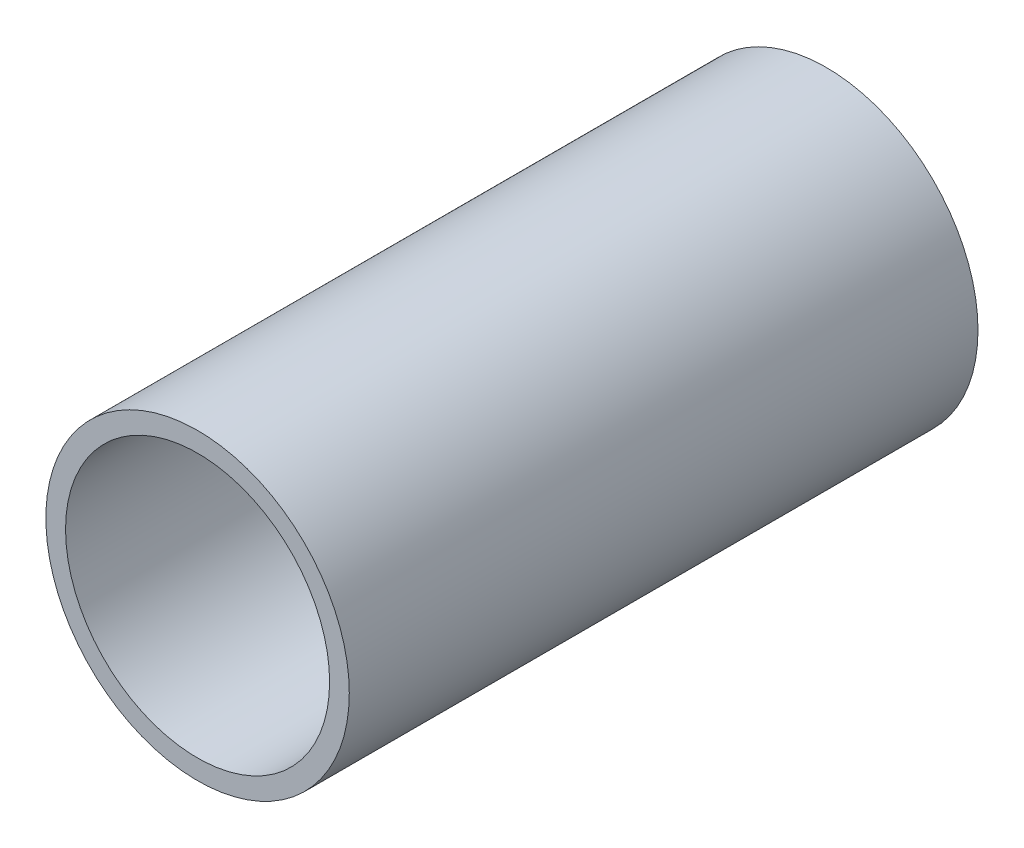
ISO-10303-21;
HEADER;
FILE_DESCRIPTION(('STEP AP214'),'2;1');
FILE_NAME('part.step','',(''),(''),'','','');
FILE_SCHEMA(('AUTOMOTIVE_DESIGN { 1 0 10303 214 1 1 1 1 }'));
ENDSEC;
DATA;
#1=APPLICATION_CONTEXT('core data for automotive mechanical design processes');
#2=APPLICATION_PROTOCOL_DEFINITION('international standard','automotive_design',2000,#1);
#3=PRODUCT_CONTEXT('',#1,'mechanical');
#4=PRODUCT('Part','Part','',(#3));
#5=PRODUCT_RELATED_PRODUCT_CATEGORY('part','',(#4));
#6=PRODUCT_DEFINITION_FORMATION('','',#4);
#7=PRODUCT_DEFINITION_CONTEXT('part definition',#1,'design');
#8=PRODUCT_DEFINITION('design','',#6,#7);
#9=PRODUCT_DEFINITION_SHAPE('','',#8);
#10=(LENGTH_UNIT() NAMED_UNIT(*) SI_UNIT(.MILLI.,.METRE.));
#11=(NAMED_UNIT(*) PLANE_ANGLE_UNIT() SI_UNIT($,.RADIAN.));
#12=(NAMED_UNIT(*) SI_UNIT($,.STERADIAN.) SOLID_ANGLE_UNIT());
#13=UNCERTAINTY_MEASURE_WITH_UNIT(LENGTH_MEASURE(1.E-05),#10,'distance_accuracy_value','');
#14=(GEOMETRIC_REPRESENTATION_CONTEXT(3) GLOBAL_UNCERTAINTY_ASSIGNED_CONTEXT((#13)) GLOBAL_UNIT_ASSIGNED_CONTEXT((#10,
#11,#12)) REPRESENTATION_CONTEXT('',''));
#15=CARTESIAN_POINT('',(0.,0.,0.));
#16=DIRECTION('',(0.,0.,1.));
#17=DIRECTION('',(1.,0.,0.));
#18=AXIS2_PLACEMENT_3D('',#15,#16,#17);
#19=CARTESIAN_POINT('',(0.,0.,125.));
#20=DIRECTION('',(0.,0.,1.));
#21=DIRECTION('',(1.,0.,0.));
#22=AXIS2_PLACEMENT_3D('',#19,#20,#21);
#23=PLANE('',#22);
#24=CARTESIAN_POINT('',(0.,0.,125.));
#25=DIRECTION('',(0.,0.,1.));
#26=DIRECTION('',(1.,0.,0.));
#27=AXIS2_PLACEMENT_3D('',#24,#25,#26);
#28=CIRCLE('',#27,30.165);
#29=CARTESIAN_POINT('',(30.165,0.,125.));
#30=VERTEX_POINT('',#29);
#31=EDGE_CURVE('E10',#30,#30,#28,.T.);
#32=ORIENTED_EDGE('',*,*,#31,.T.);
#33=EDGE_LOOP('',(#32));
#34=FACE_BOUND('',#33,.T.);
#35=CARTESIAN_POINT('',(0.,0.,125.));
#36=DIRECTION('',(0.,0.,1.));
#37=DIRECTION('',(1.,0.,0.));
#38=AXIS2_PLACEMENT_3D('',#35,#36,#37);
#39=CIRCLE('',#38,26.25);
#40=CARTESIAN_POINT('',(26.25,0.,125.));
#41=VERTEX_POINT('',#40);
#42=EDGE_CURVE('E52',#41,#41,#39,.T.);
#43=ORIENTED_EDGE('',*,*,#42,.F.);
#44=EDGE_LOOP('',(#43));
#45=FACE_BOUND('',#44,.T.);
#46=ADVANCED_FACE('F39',(#34,#45),#23,.T.);
#47=CARTESIAN_POINT('',(0.,0.,0.));
#48=DIRECTION('',(0.,0.,1.));
#49=DIRECTION('',(1.,0.,0.));
#50=AXIS2_PLACEMENT_3D('',#47,#48,#49);
#51=PLANE('',#50);
#52=CARTESIAN_POINT('',(0.,0.,0.));
#53=DIRECTION('',(0.,0.,1.));
#54=DIRECTION('',(1.,0.,0.));
#55=AXIS2_PLACEMENT_3D('',#52,#53,#54);
#56=CIRCLE('',#55,30.165);
#57=CARTESIAN_POINT('',(30.165,0.,0.));
#58=VERTEX_POINT('',#57);
#59=EDGE_CURVE('E43',#58,#58,#56,.T.);
#60=ORIENTED_EDGE('',*,*,#59,.F.);
#61=EDGE_LOOP('',(#60));
#62=FACE_BOUND('',#61,.T.);
#63=CARTESIAN_POINT('',(0.,0.,0.));
#64=DIRECTION('',(0.,0.,1.));
#65=DIRECTION('',(1.,0.,0.));
#66=AXIS2_PLACEMENT_3D('',#63,#64,#65);
#67=CIRCLE('',#66,26.25);
#68=CARTESIAN_POINT('',(26.25,0.,0.));
#69=VERTEX_POINT('',#68);
#70=EDGE_CURVE('E54',#69,#69,#67,.T.);
#71=ORIENTED_EDGE('',*,*,#70,.T.);
#72=EDGE_LOOP('',(#71));
#73=FACE_BOUND('',#72,.T.);
#74=ADVANCED_FACE('F66',(#62,#73),#51,.F.);
#75=CARTESIAN_POINT('',(0.,0.,125.));
#76=DIRECTION('',(0.,0.,-1.));
#77=DIRECTION('',(-1.,0.,0.));
#78=AXIS2_PLACEMENT_3D('',#75,#76,#77);
#79=CYLINDRICAL_SURFACE('',#78,30.165);
#80=ORIENTED_EDGE('',*,*,#31,.F.);
#81=EDGE_LOOP('',(#80));
#82=FACE_BOUND('',#81,.T.);
#83=ORIENTED_EDGE('',*,*,#59,.T.);
#84=EDGE_LOOP('',(#83));
#85=FACE_BOUND('',#84,.T.);
#86=ADVANCED_FACE('F41',(#82,#85),#79,.T.);
#87=CARTESIAN_POINT('',(0.,0.,125.));
#88=DIRECTION('',(0.,0.,-1.));
#89=DIRECTION('',(-1.,0.,0.));
#90=AXIS2_PLACEMENT_3D('',#87,#88,#89);
#91=CYLINDRICAL_SURFACE('',#90,26.25);
#92=ORIENTED_EDGE('',*,*,#42,.T.);
#93=EDGE_LOOP('',(#92));
#94=FACE_BOUND('',#93,.T.);
#95=ORIENTED_EDGE('',*,*,#70,.F.);
#96=EDGE_LOOP('',(#95));
#97=FACE_BOUND('',#96,.T.);
#98=ADVANCED_FACE('F62',(#94,#97),#91,.F.);
#99=CLOSED_SHELL('',(#46,#74,#86,#98));
#100=MANIFOLD_SOLID_BREP('B2',#99);
#101=ADVANCED_BREP_SHAPE_REPRESENTATION('',(#18,#100),#14);
#102=SHAPE_DEFINITION_REPRESENTATION(#9,#101);
ENDSEC;
END-ISO-10303-21;
